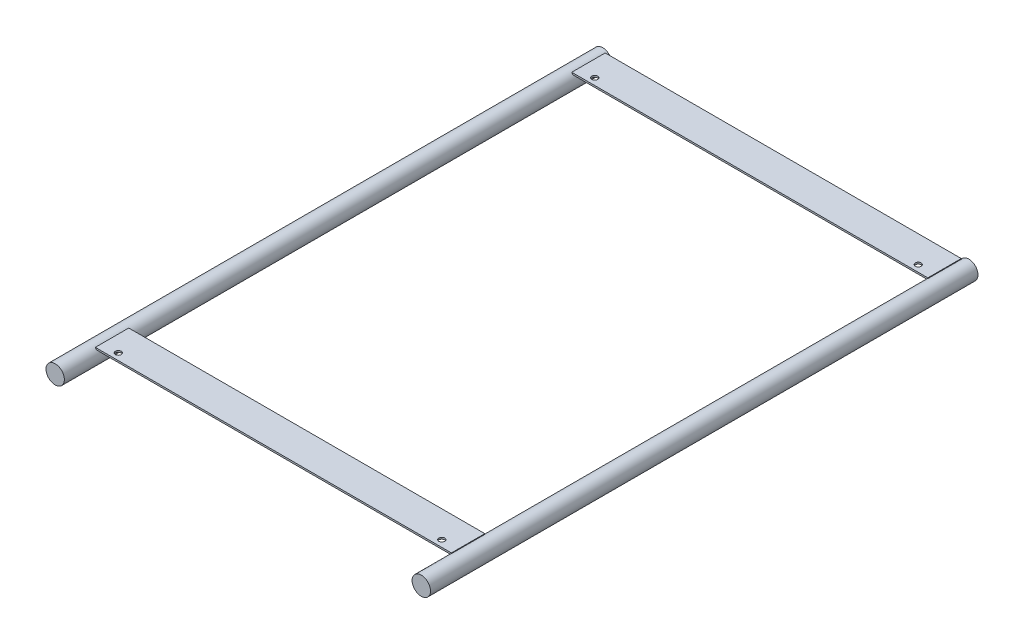
ISO-10303-21;
HEADER;
FILE_DESCRIPTION(('STEP AP214'),'2;1');
FILE_NAME('part.step','',(''),(''),'','','');
FILE_SCHEMA(('AUTOMOTIVE_DESIGN { 1 0 10303 214 1 1 1 1 }'));
ENDSEC;
DATA;
#1=APPLICATION_CONTEXT('core data for automotive mechanical design processes');
#2=APPLICATION_PROTOCOL_DEFINITION('international standard','automotive_design',2000,#1);
#3=PRODUCT_CONTEXT('',#1,'mechanical');
#4=PRODUCT('Part','Part','',(#3));
#5=PRODUCT_RELATED_PRODUCT_CATEGORY('part','',(#4));
#6=PRODUCT_DEFINITION_FORMATION('','',#4);
#7=PRODUCT_DEFINITION_CONTEXT('part definition',#1,'design');
#8=PRODUCT_DEFINITION('design','',#6,#7);
#9=PRODUCT_DEFINITION_SHAPE('','',#8);
#10=(LENGTH_UNIT() NAMED_UNIT(*) SI_UNIT(.MILLI.,.METRE.));
#11=(NAMED_UNIT(*) PLANE_ANGLE_UNIT() SI_UNIT($,.RADIAN.));
#12=(NAMED_UNIT(*) SI_UNIT($,.STERADIAN.) SOLID_ANGLE_UNIT());
#13=UNCERTAINTY_MEASURE_WITH_UNIT(LENGTH_MEASURE(1.E-05),#10,'distance_accuracy_value','');
#14=(GEOMETRIC_REPRESENTATION_CONTEXT(3) GLOBAL_UNCERTAINTY_ASSIGNED_CONTEXT((#13)) GLOBAL_UNIT_ASSIGNED_CONTEXT((#10,
#11,#12)) REPRESENTATION_CONTEXT('',''));
#15=CARTESIAN_POINT('',(0.,0.,0.));
#16=DIRECTION('',(0.,0.,1.));
#17=DIRECTION('',(1.,0.,0.));
#18=AXIS2_PLACEMENT_3D('',#15,#16,#17);
#19=CARTESIAN_POINT('',(-219.,0.,655.));
#20=DIRECTION('',(0.,0.,-1.));
#21=DIRECTION('',(-1.,0.,0.));
#22=AXIS2_PLACEMENT_3D('',#19,#20,#21);
#23=CYLINDRICAL_SURFACE('',#22,11.);
#24=CARTESIAN_POINT('',(-219.,0.,3.));
#25=DIRECTION('',(0.,0.,1.));
#26=DIRECTION('',(1.,0.,0.));
#27=AXIS2_PLACEMENT_3D('',#24,#25,#26);
#28=CIRCLE('',#27,11.);
#29=CARTESIAN_POINT('',(-211.450165564729,8.,3.));
#30=VERTEX_POINT('',#29);
#31=CARTESIAN_POINT('',(-213.,9.21954445729284,3.));
#32=VERTEX_POINT('',#31);
#33=EDGE_CURVE('E211',#30,#32,#28,.T.);
#34=ORIENTED_EDGE('',*,*,#33,.F.);
#35=DIRECTION('',(0.,0.,-1.));
#36=VECTOR('',#35,1.);
#37=CARTESIAN_POINT('',(-211.450165564729,8.,655.));
#38=LINE('',#37,#36);
#39=CARTESIAN_POINT('',(-211.450165564729,8.,42.9999999999999));
#40=VERTEX_POINT('',#39);
#41=EDGE_CURVE('E200',#40,#30,#38,.T.);
#42=ORIENTED_EDGE('',*,*,#41,.F.);
#43=CARTESIAN_POINT('',(-219.,0.,43.));
#44=DIRECTION('',(0.,0.,-1.));
#45=DIRECTION('',(-1.,0.,0.));
#46=AXIS2_PLACEMENT_3D('',#43,#44,#45);
#47=CIRCLE('',#46,11.);
#48=CARTESIAN_POINT('',(-213.,9.21954445729284,43.));
#49=VERTEX_POINT('',#48);
#50=EDGE_CURVE('E205',#49,#40,#47,.T.);
#51=ORIENTED_EDGE('',*,*,#50,.F.);
#52=DIRECTION('',(0.,0.,-1.));
#53=VECTOR('',#52,1.);
#54=CARTESIAN_POINT('',(-213.,9.21954445729284,655.));
#55=LINE('',#54,#53);
#56=EDGE_CURVE('E208',#32,#49,#55,.F.);
#57=ORIENTED_EDGE('',*,*,#56,.F.);
#58=EDGE_LOOP('',(#34,#42,#51,#57));
#59=FACE_BOUND('',#58,.T.);
#60=CARTESIAN_POINT('',(-219.,0.,655.));
#61=DIRECTION('',(0.,0.,1.));
#62=DIRECTION('',(1.,0.,0.));
#63=AXIS2_PLACEMENT_3D('',#60,#61,#62);
#64=CIRCLE('',#63,11.);
#65=CARTESIAN_POINT('',(-208.,0.,655.));
#66=VERTEX_POINT('',#65);
#67=EDGE_CURVE('E197',#66,#66,#64,.T.);
#68=ORIENTED_EDGE('',*,*,#67,.F.);
#69=EDGE_LOOP('',(#68));
#70=FACE_BOUND('',#69,.T.);
#71=CARTESIAN_POINT('',(-219.,0.,0.));
#72=DIRECTION('',(0.,0.,1.));
#73=DIRECTION('',(1.,0.,0.));
#74=AXIS2_PLACEMENT_3D('',#71,#72,#73);
#75=CIRCLE('',#74,11.);
#76=CARTESIAN_POINT('',(-208.,0.,0.));
#77=VERTEX_POINT('',#76);
#78=EDGE_CURVE('E196',#77,#77,#75,.T.);
#79=ORIENTED_EDGE('',*,*,#78,.T.);
#80=EDGE_LOOP('',(#79));
#81=FACE_BOUND('',#80,.T.);
#82=CARTESIAN_POINT('',(-219.,0.,573.));
#83=DIRECTION('',(0.,0.,1.));
#84=DIRECTION('',(1.,0.,0.));
#85=AXIS2_PLACEMENT_3D('',#82,#83,#84);
#86=CIRCLE('',#85,11.);
#87=CARTESIAN_POINT('',(-211.450165564729,8.,573.));
#88=VERTEX_POINT('',#87);
#89=CARTESIAN_POINT('',(-213.,9.21954445729284,573.));
#90=VERTEX_POINT('',#89);
#91=EDGE_CURVE('E154',#88,#90,#86,.T.);
#92=ORIENTED_EDGE('',*,*,#91,.F.);
#93=DIRECTION('',(0.,0.,-1.));
#94=VECTOR('',#93,1.);
#95=CARTESIAN_POINT('',(-211.450165564729,8.,655.));
#96=LINE('',#95,#94);
#97=CARTESIAN_POINT('',(-211.450165564729,8.,613.));
#98=VERTEX_POINT('',#97);
#99=EDGE_CURVE('E145',#98,#88,#96,.T.);
#100=ORIENTED_EDGE('',*,*,#99,.F.);
#101=CARTESIAN_POINT('',(-219.,0.,613.));
#102=DIRECTION('',(0.,0.,-1.));
#103=DIRECTION('',(-1.,0.,0.));
#104=AXIS2_PLACEMENT_3D('',#101,#102,#103);
#105=CIRCLE('',#104,11.);
#106=CARTESIAN_POINT('',(-213.,9.21954445729284,613.));
#107=VERTEX_POINT('',#106);
#108=EDGE_CURVE('E53',#107,#98,#105,.T.);
#109=ORIENTED_EDGE('',*,*,#108,.F.);
#110=DIRECTION('',(0.,0.,-1.));
#111=VECTOR('',#110,1.);
#112=CARTESIAN_POINT('',(-213.,9.21954445729284,655.));
#113=LINE('',#112,#111);
#114=EDGE_CURVE('E11',#90,#107,#113,.F.);
#115=ORIENTED_EDGE('',*,*,#114,.F.);
#116=EDGE_LOOP('',(#92,#100,#109,#115));
#117=FACE_BOUND('',#116,.T.);
#118=ADVANCED_FACE('F36',(#59,#70,#81,#117),#23,.T.);
#119=CARTESIAN_POINT('',(219.,0.,655.));
#120=DIRECTION('',(0.,0.,-1.));
#121=DIRECTION('',(-1.,0.,0.));
#122=AXIS2_PLACEMENT_3D('',#119,#120,#121);
#123=CYLINDRICAL_SURFACE('',#122,11.);
#124=DIRECTION('',(0.,0.,-1.));
#125=VECTOR('',#124,1.);
#126=CARTESIAN_POINT('',(211.450165564729,8.,655.));
#127=LINE('',#126,#125);
#128=CARTESIAN_POINT('',(211.450165564729,8.,42.9999999999999));
#129=VERTEX_POINT('',#128);
#130=CARTESIAN_POINT('',(211.450165564729,8.,3.));
#131=VERTEX_POINT('',#130);
#132=EDGE_CURVE('E165',#129,#131,#127,.T.);
#133=ORIENTED_EDGE('',*,*,#132,.T.);
#134=CARTESIAN_POINT('',(219.,0.,3.));
#135=DIRECTION('',(0.,0.,1.));
#136=DIRECTION('',(1.,0.,0.));
#137=AXIS2_PLACEMENT_3D('',#134,#135,#136);
#138=CIRCLE('',#137,11.);
#139=CARTESIAN_POINT('',(213.,9.21954445729298,3.));
#140=VERTEX_POINT('',#139);
#141=EDGE_CURVE('E168',#131,#140,#138,.F.);
#142=ORIENTED_EDGE('',*,*,#141,.T.);
#143=DIRECTION('',(0.,0.,-1.));
#144=VECTOR('',#143,1.);
#145=CARTESIAN_POINT('',(213.,9.21954445729269,655.));
#146=LINE('',#145,#144);
#147=CARTESIAN_POINT('',(213.,9.21954445729296,42.9999999999999));
#148=VERTEX_POINT('',#147);
#149=EDGE_CURVE('E160',#140,#148,#146,.F.);
#150=ORIENTED_EDGE('',*,*,#149,.T.);
#151=CARTESIAN_POINT('',(219.,0.,42.9999999999999));
#152=DIRECTION('',(0.,0.,-1.));
#153=DIRECTION('',(-1.,0.,0.));
#154=AXIS2_PLACEMENT_3D('',#151,#152,#153);
#155=CIRCLE('',#154,11.);
#156=EDGE_CURVE('E214',#148,#129,#155,.F.);
#157=ORIENTED_EDGE('',*,*,#156,.T.);
#158=EDGE_LOOP('',(#133,#142,#150,#157));
#159=FACE_BOUND('',#158,.T.);
#160=CARTESIAN_POINT('',(219.,0.,0.));
#161=DIRECTION('',(0.,0.,1.));
#162=DIRECTION('',(1.,0.,0.));
#163=AXIS2_PLACEMENT_3D('',#160,#161,#162);
#164=CIRCLE('',#163,11.);
#165=CARTESIAN_POINT('',(230.,0.,0.));
#166=VERTEX_POINT('',#165);
#167=EDGE_CURVE('E157',#166,#166,#164,.T.);
#168=ORIENTED_EDGE('',*,*,#167,.T.);
#169=EDGE_LOOP('',(#168));
#170=FACE_BOUND('',#169,.T.);
#171=CARTESIAN_POINT('',(219.,0.,655.));
#172=DIRECTION('',(0.,0.,1.));
#173=DIRECTION('',(1.,0.,0.));
#174=AXIS2_PLACEMENT_3D('',#171,#172,#173);
#175=CIRCLE('',#174,11.);
#176=CARTESIAN_POINT('',(230.,0.,655.));
#177=VERTEX_POINT('',#176);
#178=EDGE_CURVE('E156',#177,#177,#175,.T.);
#179=ORIENTED_EDGE('',*,*,#178,.F.);
#180=EDGE_LOOP('',(#179));
#181=FACE_BOUND('',#180,.T.);
#182=DIRECTION('',(0.,0.,-1.));
#183=VECTOR('',#182,1.);
#184=CARTESIAN_POINT('',(213.,9.21954445729294,655.));
#185=LINE('',#184,#183);
#186=CARTESIAN_POINT('',(213.,9.21954445729296,613.));
#187=VERTEX_POINT('',#186);
#188=CARTESIAN_POINT('',(213.,9.21954445729298,573.));
#189=VERTEX_POINT('',#188);
#190=EDGE_CURVE('E43',#187,#189,#185,.T.);
#191=ORIENTED_EDGE('',*,*,#190,.F.);
#192=CARTESIAN_POINT('',(219.,0.,613.));
#193=DIRECTION('',(0.,0.,-1.));
#194=DIRECTION('',(-1.,0.,0.));
#195=AXIS2_PLACEMENT_3D('',#192,#193,#194);
#196=CIRCLE('',#195,11.);
#197=CARTESIAN_POINT('',(211.450165564729,8.,613.));
#198=VERTEX_POINT('',#197);
#199=EDGE_CURVE('E220',#198,#187,#196,.T.);
#200=ORIENTED_EDGE('',*,*,#199,.F.);
#201=DIRECTION('',(0.,0.,-1.));
#202=VECTOR('',#201,1.);
#203=CARTESIAN_POINT('',(211.450165564729,8.,655.));
#204=LINE('',#203,#202);
#205=CARTESIAN_POINT('',(211.450165564729,8.,573.));
#206=VERTEX_POINT('',#205);
#207=EDGE_CURVE('E217',#206,#198,#204,.F.);
#208=ORIENTED_EDGE('',*,*,#207,.F.);
#209=CARTESIAN_POINT('',(219.,0.,573.));
#210=DIRECTION('',(0.,0.,1.));
#211=DIRECTION('',(1.,0.,0.));
#212=AXIS2_PLACEMENT_3D('',#209,#210,#211);
#213=CIRCLE('',#212,11.);
#214=EDGE_CURVE('E223',#189,#206,#213,.T.);
#215=ORIENTED_EDGE('',*,*,#214,.F.);
#216=EDGE_LOOP('',(#191,#200,#208,#215));
#217=FACE_BOUND('',#216,.T.);
#218=ADVANCED_FACE('F296',(#159,#170,#181,#217),#123,.T.);
#219=CARTESIAN_POINT('',(0.,8.,0.));
#220=DIRECTION('',(0.,1.,0.));
#221=DIRECTION('',(0.,0.,1.));
#222=AXIS2_PLACEMENT_3D('',#219,#220,#221);
#223=PLANE('',#222);
#224=CARTESIAN_POINT('',(-193.5,8.,35.));
#225=DIRECTION('',(0.,1.,0.));
#226=DIRECTION('',(0.,0.,1.));
#227=AXIS2_PLACEMENT_3D('',#224,#225,#226);
#228=CIRCLE('',#227,3.49999999999999);
#229=CARTESIAN_POINT('',(-193.5,8.,38.5));
#230=VERTEX_POINT('',#229);
#231=EDGE_CURVE('E231',#230,#230,#228,.T.);
#232=ORIENTED_EDGE('',*,*,#231,.T.);
#233=EDGE_LOOP('',(#232));
#234=FACE_BOUND('',#233,.T.);
#235=CARTESIAN_POINT('',(193.5,8.,35.));
#236=DIRECTION('',(0.,1.,0.));
#237=DIRECTION('',(0.,0.,1.));
#238=AXIS2_PLACEMENT_3D('',#235,#236,#237);
#239=CIRCLE('',#238,3.49999999999999);
#240=CARTESIAN_POINT('',(193.5,8.,38.4999999999999));
#241=VERTEX_POINT('',#240);
#242=EDGE_CURVE('E235',#241,#241,#239,.T.);
#243=ORIENTED_EDGE('',*,*,#242,.T.);
#244=EDGE_LOOP('',(#243));
#245=FACE_BOUND('',#244,.T.);
#246=ORIENTED_EDGE('',*,*,#132,.F.);
#247=DIRECTION('',(1.,0.,0.));
#248=VECTOR('',#247,1.);
#249=CARTESIAN_POINT('',(-213.,8.,43.));
#250=LINE('',#249,#248);
#251=EDGE_CURVE('E176',#40,#129,#250,.T.);
#252=ORIENTED_EDGE('',*,*,#251,.F.);
#253=ORIENTED_EDGE('',*,*,#41,.T.);
#254=DIRECTION('',(-1.,0.,0.));
#255=VECTOR('',#254,1.);
#256=CARTESIAN_POINT('',(-213.,8.,3.));
#257=LINE('',#256,#255);
#258=EDGE_CURVE('E171',#131,#30,#257,.T.);
#259=ORIENTED_EDGE('',*,*,#258,.F.);
#260=EDGE_LOOP('',(#246,#252,#253,#259));
#261=FACE_BOUND('',#260,.T.);
#262=ADVANCED_FACE('F301',(#234,#245,#261),#223,.F.);
#263=CARTESIAN_POINT('',(213.,10.,2.99999999999995));
#264=DIRECTION('',(-1.,0.,0.));
#265=DIRECTION('',(0.,0.,1.));
#266=AXIS2_PLACEMENT_3D('',#263,#264,#265);
#267=PLANE('',#266);
#268=ORIENTED_EDGE('',*,*,#149,.F.);
#269=DIRECTION('',(0.,-1.,0.));
#270=VECTOR('',#269,1.);
#271=CARTESIAN_POINT('',(213.,10.,2.99999999999995));
#272=LINE('',#271,#270);
#273=CARTESIAN_POINT('',(213.,10.,2.99999999999995));
#274=VERTEX_POINT('',#273);
#275=EDGE_CURVE('E193',#274,#140,#272,.T.);
#276=ORIENTED_EDGE('',*,*,#275,.F.);
#277=DIRECTION('',(0.,0.,-1.));
#278=VECTOR('',#277,1.);
#279=CARTESIAN_POINT('',(213.,10.,2.99999999999995));
#280=LINE('',#279,#278);
#281=CARTESIAN_POINT('',(213.,10.,43.));
#282=VERTEX_POINT('',#281);
#283=EDGE_CURVE('E172',#282,#274,#280,.T.);
#284=ORIENTED_EDGE('',*,*,#283,.F.);
#285=DIRECTION('',(0.,-1.,0.));
#286=VECTOR('',#285,1.);
#287=CARTESIAN_POINT('',(213.,10.,43.));
#288=LINE('',#287,#286);
#289=EDGE_CURVE('E182',#282,#148,#288,.T.);
#290=ORIENTED_EDGE('',*,*,#289,.T.);
#291=EDGE_LOOP('',(#268,#276,#284,#290));
#292=FACE_BOUND('',#291,.T.);
#293=ADVANCED_FACE('F321',(#292),#267,.F.);
#294=CARTESIAN_POINT('',(-219.,0.,655.));
#295=DIRECTION('',(0.,0.,1.));
#296=DIRECTION('',(1.,0.,0.));
#297=AXIS2_PLACEMENT_3D('',#294,#295,#296);
#298=PLANE('',#297);
#299=ORIENTED_EDGE('',*,*,#67,.T.);
#300=EDGE_LOOP('',(#299));
#301=FACE_BOUND('',#300,.T.);
#302=ADVANCED_FACE('F313',(#301),#298,.T.);
#303=CARTESIAN_POINT('',(-219.,0.,0.));
#304=DIRECTION('',(0.,0.,1.));
#305=DIRECTION('',(1.,0.,0.));
#306=AXIS2_PLACEMENT_3D('',#303,#304,#305);
#307=PLANE('',#306);
#308=ORIENTED_EDGE('',*,*,#78,.F.);
#309=EDGE_LOOP('',(#308));
#310=FACE_BOUND('',#309,.T.);
#311=ADVANCED_FACE('F310',(#310),#307,.F.);
#312=CARTESIAN_POINT('',(-213.,10.,3.));
#313=DIRECTION('',(1.,0.,0.));
#314=DIRECTION('',(0.,0.,-1.));
#315=AXIS2_PLACEMENT_3D('',#312,#313,#314);
#316=PLANE('',#315);
#317=DIRECTION('',(0.,-1.,0.));
#318=VECTOR('',#317,1.);
#319=CARTESIAN_POINT('',(-213.,10.,3.));
#320=LINE('',#319,#318);
#321=CARTESIAN_POINT('',(-213.,10.,3.));
#322=VERTEX_POINT('',#321);
#323=EDGE_CURVE('E190',#322,#32,#320,.T.);
#324=ORIENTED_EDGE('',*,*,#323,.T.);
#325=ORIENTED_EDGE('',*,*,#56,.T.);
#326=DIRECTION('',(0.,-1.,0.));
#327=VECTOR('',#326,1.);
#328=CARTESIAN_POINT('',(-213.,10.,43.));
#329=LINE('',#328,#327);
#330=CARTESIAN_POINT('',(-213.,10.,43.));
#331=VERTEX_POINT('',#330);
#332=EDGE_CURVE('E187',#331,#49,#329,.T.);
#333=ORIENTED_EDGE('',*,*,#332,.F.);
#334=DIRECTION('',(0.,0.,1.));
#335=VECTOR('',#334,1.);
#336=CARTESIAN_POINT('',(-213.,10.,3.));
#337=LINE('',#336,#335);
#338=EDGE_CURVE('E178',#322,#331,#337,.T.);
#339=ORIENTED_EDGE('',*,*,#338,.F.);
#340=EDGE_LOOP('',(#324,#325,#333,#339));
#341=FACE_BOUND('',#340,.T.);
#342=ADVANCED_FACE('F312',(#341),#316,.F.);
#343=CARTESIAN_POINT('',(-213.,10.,3.));
#344=DIRECTION('',(0.,0.,1.));
#345=DIRECTION('',(1.,0.,0.));
#346=AXIS2_PLACEMENT_3D('',#343,#344,#345);
#347=PLANE('',#346);
#348=ORIENTED_EDGE('',*,*,#141,.F.);
#349=ORIENTED_EDGE('',*,*,#258,.T.);
#350=ORIENTED_EDGE('',*,*,#33,.T.);
#351=ORIENTED_EDGE('',*,*,#323,.F.);
#352=DIRECTION('',(-1.,0.,0.));
#353=VECTOR('',#352,1.);
#354=CARTESIAN_POINT('',(-213.,10.,3.));
#355=LINE('',#354,#353);
#356=EDGE_CURVE('E175',#274,#322,#355,.T.);
#357=ORIENTED_EDGE('',*,*,#356,.F.);
#358=ORIENTED_EDGE('',*,*,#275,.T.);
#359=EDGE_LOOP('',(#348,#349,#350,#351,#357,#358));
#360=FACE_BOUND('',#359,.T.);
#361=ADVANCED_FACE('F318',(#360),#347,.F.);
#362=CARTESIAN_POINT('',(-213.,10.,43.));
#363=DIRECTION('',(0.,0.,-1.));
#364=DIRECTION('',(-1.,0.,0.));
#365=AXIS2_PLACEMENT_3D('',#362,#363,#364);
#366=PLANE('',#365);
#367=ORIENTED_EDGE('',*,*,#156,.F.);
#368=ORIENTED_EDGE('',*,*,#289,.F.);
#369=DIRECTION('',(1.,0.,0.));
#370=VECTOR('',#369,1.);
#371=CARTESIAN_POINT('',(-213.,10.,43.));
#372=LINE('',#371,#370);
#373=EDGE_CURVE('E180',#331,#282,#372,.T.);
#374=ORIENTED_EDGE('',*,*,#373,.F.);
#375=ORIENTED_EDGE('',*,*,#332,.T.);
#376=ORIENTED_EDGE('',*,*,#50,.T.);
#377=ORIENTED_EDGE('',*,*,#251,.T.);
#378=EDGE_LOOP('',(#367,#368,#374,#375,#376,#377));
#379=FACE_BOUND('',#378,.T.);
#380=ADVANCED_FACE('F329',(#379),#366,.F.);
#381=CARTESIAN_POINT('',(0.,10.,0.));
#382=DIRECTION('',(0.,1.,0.));
#383=DIRECTION('',(0.,0.,1.));
#384=AXIS2_PLACEMENT_3D('',#381,#382,#383);
#385=PLANE('',#384);
#386=CARTESIAN_POINT('',(-193.5,10.,35.));
#387=DIRECTION('',(0.,1.,0.));
#388=DIRECTION('',(0.,0.,1.));
#389=AXIS2_PLACEMENT_3D('',#386,#387,#388);
#390=CIRCLE('',#389,3.49999999999999);
#391=CARTESIAN_POINT('',(-193.5,10.,38.5));
#392=VERTEX_POINT('',#391);
#393=EDGE_CURVE('E250',#392,#392,#390,.T.);
#394=ORIENTED_EDGE('',*,*,#393,.F.);
#395=EDGE_LOOP('',(#394));
#396=FACE_BOUND('',#395,.T.);
#397=CARTESIAN_POINT('',(193.5,10.,35.));
#398=DIRECTION('',(0.,1.,0.));
#399=DIRECTION('',(0.,0.,-1.));
#400=AXIS2_PLACEMENT_3D('',#397,#398,#399);
#401=CIRCLE('',#400,3.49999999999999);
#402=CARTESIAN_POINT('',(193.5,10.,31.5));
#403=VERTEX_POINT('',#402);
#404=EDGE_CURVE('E251',#403,#403,#401,.T.);
#405=ORIENTED_EDGE('',*,*,#404,.F.);
#406=EDGE_LOOP('',(#405));
#407=FACE_BOUND('',#406,.T.);
#408=ORIENTED_EDGE('',*,*,#283,.T.);
#409=ORIENTED_EDGE('',*,*,#356,.T.);
#410=ORIENTED_EDGE('',*,*,#338,.T.);
#411=ORIENTED_EDGE('',*,*,#373,.T.);
#412=EDGE_LOOP('',(#408,#409,#410,#411));
#413=FACE_BOUND('',#412,.T.);
#414=ADVANCED_FACE('F334',(#396,#407,#413),#385,.T.);
#415=CARTESIAN_POINT('',(219.,0.,655.));
#416=DIRECTION('',(0.,0.,1.));
#417=DIRECTION('',(1.,0.,0.));
#418=AXIS2_PLACEMENT_3D('',#415,#416,#417);
#419=PLANE('',#418);
#420=ORIENTED_EDGE('',*,*,#178,.T.);
#421=EDGE_LOOP('',(#420));
#422=FACE_BOUND('',#421,.T.);
#423=ADVANCED_FACE('F341',(#422),#419,.T.);
#424=CARTESIAN_POINT('',(219.,0.,0.));
#425=DIRECTION('',(0.,0.,1.));
#426=DIRECTION('',(1.,0.,0.));
#427=AXIS2_PLACEMENT_3D('',#424,#425,#426);
#428=PLANE('',#427);
#429=ORIENTED_EDGE('',*,*,#167,.F.);
#430=EDGE_LOOP('',(#429));
#431=FACE_BOUND('',#430,.T.);
#432=ADVANCED_FACE('F345',(#431),#428,.F.);
#433=CARTESIAN_POINT('',(-213.,10.,573.));
#434=DIRECTION('',(1.,0.,0.));
#435=DIRECTION('',(0.,0.,-1.));
#436=AXIS2_PLACEMENT_3D('',#433,#434,#435);
#437=PLANE('',#436);
#438=DIRECTION('',(0.,-1.,0.));
#439=VECTOR('',#438,1.);
#440=CARTESIAN_POINT('',(-213.,10.,573.));
#441=LINE('',#440,#439);
#442=CARTESIAN_POINT('',(-213.,10.,573.));
#443=VERTEX_POINT('',#442);
#444=EDGE_CURVE('E128',#443,#90,#441,.T.);
#445=ORIENTED_EDGE('',*,*,#444,.T.);
#446=ORIENTED_EDGE('',*,*,#114,.T.);
#447=DIRECTION('',(0.,-1.,0.));
#448=VECTOR('',#447,1.);
#449=CARTESIAN_POINT('',(-213.,10.,613.));
#450=LINE('',#449,#448);
#451=CARTESIAN_POINT('',(-213.,10.,613.));
#452=VERTEX_POINT('',#451);
#453=EDGE_CURVE('E149',#452,#107,#450,.T.);
#454=ORIENTED_EDGE('',*,*,#453,.F.);
#455=DIRECTION('',(0.,0.,1.));
#456=VECTOR('',#455,1.);
#457=CARTESIAN_POINT('',(-213.,10.,573.));
#458=LINE('',#457,#456);
#459=EDGE_CURVE('E131',#443,#452,#458,.T.);
#460=ORIENTED_EDGE('',*,*,#459,.F.);
#461=EDGE_LOOP('',(#445,#446,#454,#460));
#462=FACE_BOUND('',#461,.T.);
#463=ADVANCED_FACE('F246',(#462),#437,.F.);
#464=CARTESIAN_POINT('',(213.,10.,573.));
#465=DIRECTION('',(-1.,0.,0.));
#466=DIRECTION('',(0.,0.,1.));
#467=AXIS2_PLACEMENT_3D('',#464,#465,#466);
#468=PLANE('',#467);
#469=DIRECTION('',(0.,-1.,0.));
#470=VECTOR('',#469,1.);
#471=CARTESIAN_POINT('',(213.,10.,613.));
#472=LINE('',#471,#470);
#473=CARTESIAN_POINT('',(213.,10.,613.));
#474=VERTEX_POINT('',#473);
#475=EDGE_CURVE('E240',#474,#187,#472,.T.);
#476=ORIENTED_EDGE('',*,*,#475,.T.);
#477=ORIENTED_EDGE('',*,*,#190,.T.);
#478=DIRECTION('',(0.,-1.,0.));
#479=VECTOR('',#478,1.);
#480=CARTESIAN_POINT('',(213.,10.,573.));
#481=LINE('',#480,#479);
#482=CARTESIAN_POINT('',(213.,10.,573.));
#483=VERTEX_POINT('',#482);
#484=EDGE_CURVE('E126',#483,#189,#481,.T.);
#485=ORIENTED_EDGE('',*,*,#484,.F.);
#486=DIRECTION('',(0.,0.,-1.));
#487=VECTOR('',#486,1.);
#488=CARTESIAN_POINT('',(213.,10.,573.));
#489=LINE('',#488,#487);
#490=EDGE_CURVE('E132',#474,#483,#489,.T.);
#491=ORIENTED_EDGE('',*,*,#490,.F.);
#492=EDGE_LOOP('',(#476,#477,#485,#491));
#493=FACE_BOUND('',#492,.T.);
#494=ADVANCED_FACE('F144',(#493),#468,.F.);
#495=CARTESIAN_POINT('',(0.,8.,570.));
#496=DIRECTION('',(0.,1.,0.));
#497=DIRECTION('',(0.,0.,1.));
#498=AXIS2_PLACEMENT_3D('',#495,#496,#497);
#499=PLANE('',#498);
#500=CARTESIAN_POINT('',(-193.5,8.,605.));
#501=DIRECTION('',(0.,1.,0.));
#502=DIRECTION('',(0.,0.,1.));
#503=AXIS2_PLACEMENT_3D('',#500,#501,#502);
#504=CIRCLE('',#503,3.49999999999999);
#505=CARTESIAN_POINT('',(-193.5,8.,608.5));
#506=VERTEX_POINT('',#505);
#507=EDGE_CURVE('E254',#506,#506,#504,.T.);
#508=ORIENTED_EDGE('',*,*,#507,.T.);
#509=EDGE_LOOP('',(#508));
#510=FACE_BOUND('',#509,.T.);
#511=CARTESIAN_POINT('',(193.5,8.,605.));
#512=DIRECTION('',(0.,1.,0.));
#513=DIRECTION('',(0.,0.,1.));
#514=AXIS2_PLACEMENT_3D('',#511,#512,#513);
#515=CIRCLE('',#514,3.49999999999999);
#516=CARTESIAN_POINT('',(193.5,8.,608.5));
#517=VERTEX_POINT('',#516);
#518=EDGE_CURVE('E259',#517,#517,#515,.T.);
#519=ORIENTED_EDGE('',*,*,#518,.T.);
#520=EDGE_LOOP('',(#519));
#521=FACE_BOUND('',#520,.T.);
#522=DIRECTION('',(1.,0.,0.));
#523=VECTOR('',#522,1.);
#524=CARTESIAN_POINT('',(-213.,8.,613.));
#525=LINE('',#524,#523);
#526=EDGE_CURVE('E141',#98,#198,#525,.T.);
#527=ORIENTED_EDGE('',*,*,#526,.F.);
#528=ORIENTED_EDGE('',*,*,#99,.T.);
#529=DIRECTION('',(-1.,0.,0.));
#530=VECTOR('',#529,1.);
#531=CARTESIAN_POINT('',(-213.,8.,573.));
#532=LINE('',#531,#530);
#533=EDGE_CURVE('E225',#206,#88,#532,.T.);
#534=ORIENTED_EDGE('',*,*,#533,.F.);
#535=ORIENTED_EDGE('',*,*,#207,.T.);
#536=EDGE_LOOP('',(#527,#528,#534,#535));
#537=FACE_BOUND('',#536,.T.);
#538=ADVANCED_FACE('F229',(#510,#521,#537),#499,.F.);
#539=CARTESIAN_POINT('',(-213.,10.,573.));
#540=DIRECTION('',(0.,0.,1.));
#541=DIRECTION('',(1.,0.,0.));
#542=AXIS2_PLACEMENT_3D('',#539,#540,#541);
#543=PLANE('',#542);
#544=ORIENTED_EDGE('',*,*,#533,.T.);
#545=ORIENTED_EDGE('',*,*,#91,.T.);
#546=ORIENTED_EDGE('',*,*,#444,.F.);
#547=DIRECTION('',(-1.,0.,0.));
#548=VECTOR('',#547,1.);
#549=CARTESIAN_POINT('',(-213.,10.,573.));
#550=LINE('',#549,#548);
#551=EDGE_CURVE('E120',#483,#443,#550,.T.);
#552=ORIENTED_EDGE('',*,*,#551,.F.);
#553=ORIENTED_EDGE('',*,*,#484,.T.);
#554=ORIENTED_EDGE('',*,*,#214,.T.);
#555=EDGE_LOOP('',(#544,#545,#546,#552,#553,#554));
#556=FACE_BOUND('',#555,.T.);
#557=ADVANCED_FACE('F123',(#556),#543,.F.);
#558=CARTESIAN_POINT('',(-213.,10.,613.));
#559=DIRECTION('',(0.,0.,-1.));
#560=DIRECTION('',(-1.,0.,0.));
#561=AXIS2_PLACEMENT_3D('',#558,#559,#560);
#562=PLANE('',#561);
#563=ORIENTED_EDGE('',*,*,#453,.T.);
#564=ORIENTED_EDGE('',*,*,#108,.T.);
#565=ORIENTED_EDGE('',*,*,#526,.T.);
#566=ORIENTED_EDGE('',*,*,#199,.T.);
#567=ORIENTED_EDGE('',*,*,#475,.F.);
#568=DIRECTION('',(1.,0.,0.));
#569=VECTOR('',#568,1.);
#570=CARTESIAN_POINT('',(-213.,10.,613.));
#571=LINE('',#570,#569);
#572=EDGE_CURVE('E137',#452,#474,#571,.T.);
#573=ORIENTED_EDGE('',*,*,#572,.F.);
#574=EDGE_LOOP('',(#563,#564,#565,#566,#567,#573));
#575=FACE_BOUND('',#574,.T.);
#576=ADVANCED_FACE('F244',(#575),#562,.F.);
#577=CARTESIAN_POINT('',(0.,10.,570.));
#578=DIRECTION('',(0.,1.,0.));
#579=DIRECTION('',(0.,0.,1.));
#580=AXIS2_PLACEMENT_3D('',#577,#578,#579);
#581=PLANE('',#580);
#582=CARTESIAN_POINT('',(-193.5,10.,605.));
#583=DIRECTION('',(0.,1.,0.));
#584=DIRECTION('',(0.,0.,1.));
#585=AXIS2_PLACEMENT_3D('',#582,#583,#584);
#586=CIRCLE('',#585,3.49999999999999);
#587=CARTESIAN_POINT('',(-193.5,10.,608.5));
#588=VERTEX_POINT('',#587);
#589=EDGE_CURVE('E262',#588,#588,#586,.T.);
#590=ORIENTED_EDGE('',*,*,#589,.F.);
#591=EDGE_LOOP('',(#590));
#592=FACE_BOUND('',#591,.T.);
#593=CARTESIAN_POINT('',(193.5,10.,605.));
#594=DIRECTION('',(0.,1.,0.));
#595=DIRECTION('',(0.,0.,-1.));
#596=AXIS2_PLACEMENT_3D('',#593,#594,#595);
#597=CIRCLE('',#596,3.49999999999999);
#598=CARTESIAN_POINT('',(193.5,10.,601.5));
#599=VERTEX_POINT('',#598);
#600=EDGE_CURVE('E263',#599,#599,#597,.T.);
#601=ORIENTED_EDGE('',*,*,#600,.F.);
#602=EDGE_LOOP('',(#601));
#603=FACE_BOUND('',#602,.T.);
#604=ORIENTED_EDGE('',*,*,#490,.T.);
#605=ORIENTED_EDGE('',*,*,#551,.T.);
#606=ORIENTED_EDGE('',*,*,#459,.T.);
#607=ORIENTED_EDGE('',*,*,#572,.T.);
#608=EDGE_LOOP('',(#604,#605,#606,#607));
#609=FACE_BOUND('',#608,.T.);
#610=ADVANCED_FACE('F135',(#592,#603,#609),#581,.T.);
#611=CARTESIAN_POINT('',(193.5,-11.,35.));
#612=DIRECTION('',(0.,1.,0.));
#613=DIRECTION('',(0.,0.,1.));
#614=AXIS2_PLACEMENT_3D('',#611,#612,#613);
#615=CYLINDRICAL_SURFACE('',#614,3.49999999999999);
#616=ORIENTED_EDGE('',*,*,#404,.T.);
#617=EDGE_LOOP('',(#616));
#618=FACE_BOUND('',#617,.T.);
#619=ORIENTED_EDGE('',*,*,#242,.F.);
#620=EDGE_LOOP('',(#619));
#621=FACE_BOUND('',#620,.T.);
#622=ADVANCED_FACE('F274',(#618,#621),#615,.F.);
#623=CARTESIAN_POINT('',(-193.5,-11.,35.));
#624=DIRECTION('',(0.,1.,0.));
#625=DIRECTION('',(0.,0.,1.));
#626=AXIS2_PLACEMENT_3D('',#623,#624,#625);
#627=CYLINDRICAL_SURFACE('',#626,3.49999999999999);
#628=ORIENTED_EDGE('',*,*,#393,.T.);
#629=EDGE_LOOP('',(#628));
#630=FACE_BOUND('',#629,.T.);
#631=ORIENTED_EDGE('',*,*,#231,.F.);
#632=EDGE_LOOP('',(#631));
#633=FACE_BOUND('',#632,.T.);
#634=ADVANCED_FACE('F281',(#630,#633),#627,.F.);
#635=CARTESIAN_POINT('',(193.5,-11.,605.));
#636=DIRECTION('',(0.,1.,0.));
#637=DIRECTION('',(0.,0.,1.));
#638=AXIS2_PLACEMENT_3D('',#635,#636,#637);
#639=CYLINDRICAL_SURFACE('',#638,3.49999999999999);
#640=ORIENTED_EDGE('',*,*,#600,.T.);
#641=EDGE_LOOP('',(#640));
#642=FACE_BOUND('',#641,.T.);
#643=ORIENTED_EDGE('',*,*,#518,.F.);
#644=EDGE_LOOP('',(#643));
#645=FACE_BOUND('',#644,.T.);
#646=ADVANCED_FACE('F278',(#642,#645),#639,.F.);
#647=CARTESIAN_POINT('',(-193.5,-11.,605.));
#648=DIRECTION('',(0.,1.,0.));
#649=DIRECTION('',(0.,0.,1.));
#650=AXIS2_PLACEMENT_3D('',#647,#648,#649);
#651=CYLINDRICAL_SURFACE('',#650,3.49999999999999);
#652=ORIENTED_EDGE('',*,*,#589,.T.);
#653=EDGE_LOOP('',(#652));
#654=FACE_BOUND('',#653,.T.);
#655=ORIENTED_EDGE('',*,*,#507,.F.);
#656=EDGE_LOOP('',(#655));
#657=FACE_BOUND('',#656,.T.);
#658=ADVANCED_FACE('F269',(#654,#657),#651,.F.);
#659=CLOSED_SHELL('',(#118,#218,#262,#293,#302,#311,#342,#361,#380,#414,#423,#432,#463,#494,
#538,#557,#576,#610,#622,#634,#646,#658));
#660=MANIFOLD_SOLID_BREP('B2',#659);
#661=ADVANCED_BREP_SHAPE_REPRESENTATION('',(#18,#660),#14);
#662=SHAPE_DEFINITION_REPRESENTATION(#9,#661);
ENDSEC;
END-ISO-10303-21;
